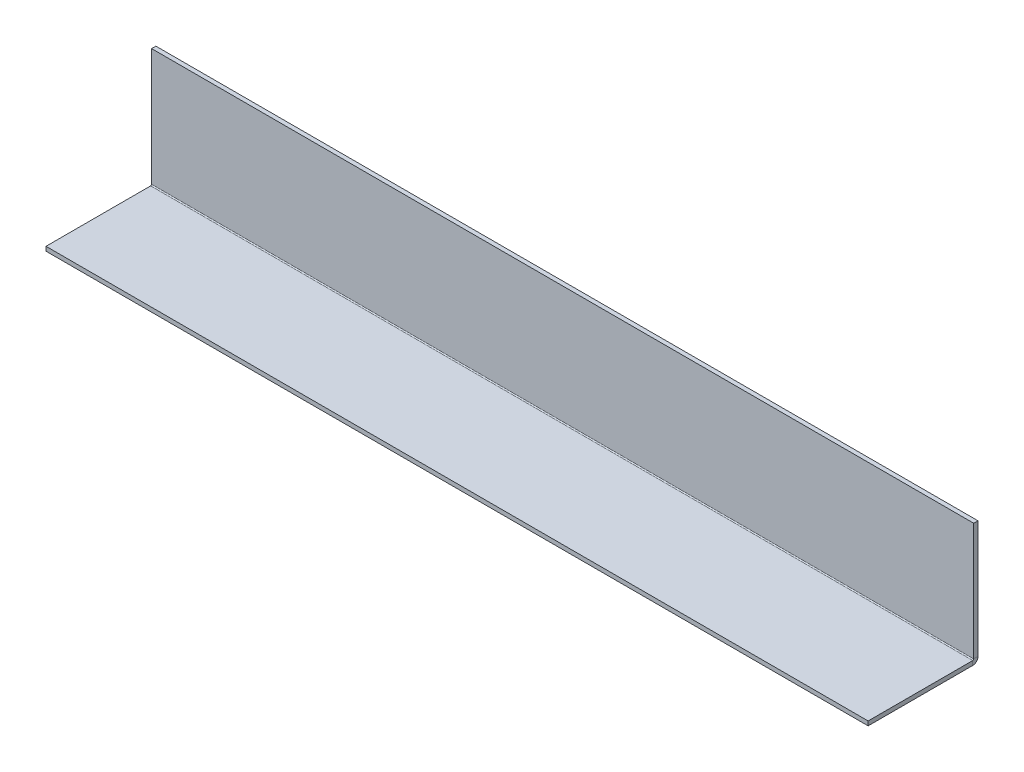
ISO-10303-21;
HEADER;
FILE_DESCRIPTION(('STEP AP214'),'2;1');
FILE_NAME('part.step','',(''),(''),'','','');
FILE_SCHEMA(('AUTOMOTIVE_DESIGN { 1 0 10303 214 1 1 1 1 }'));
ENDSEC;
DATA;
#1=APPLICATION_CONTEXT('core data for automotive mechanical design processes');
#2=APPLICATION_PROTOCOL_DEFINITION('international standard','automotive_design',2000,#1);
#3=PRODUCT_CONTEXT('',#1,'mechanical');
#4=PRODUCT('Part','Part','',(#3));
#5=PRODUCT_RELATED_PRODUCT_CATEGORY('part','',(#4));
#6=PRODUCT_DEFINITION_FORMATION('','',#4);
#7=PRODUCT_DEFINITION_CONTEXT('part definition',#1,'design');
#8=PRODUCT_DEFINITION('design','',#6,#7);
#9=PRODUCT_DEFINITION_SHAPE('','',#8);
#10=(LENGTH_UNIT() NAMED_UNIT(*) SI_UNIT(.MILLI.,.METRE.));
#11=(NAMED_UNIT(*) PLANE_ANGLE_UNIT() SI_UNIT($,.RADIAN.));
#12=(NAMED_UNIT(*) SI_UNIT($,.STERADIAN.) SOLID_ANGLE_UNIT());
#13=UNCERTAINTY_MEASURE_WITH_UNIT(LENGTH_MEASURE(1.E-05),#10,'distance_accuracy_value','');
#14=(GEOMETRIC_REPRESENTATION_CONTEXT(3) GLOBAL_UNCERTAINTY_ASSIGNED_CONTEXT((#13)) GLOBAL_UNIT_ASSIGNED_CONTEXT((#10,
#11,#12)) REPRESENTATION_CONTEXT('',''));
#15=CARTESIAN_POINT('',(0.,0.,0.));
#16=DIRECTION('',(0.,0.,1.));
#17=DIRECTION('',(1.,0.,0.));
#18=AXIS2_PLACEMENT_3D('',#15,#16,#17);
#19=CARTESIAN_POINT('',(304.8,-10.0237561284477,78.286256128448));
#20=DIRECTION('',(1.,0.,0.));
#21=DIRECTION('',(0.,-1.,0.));
#22=AXIS2_PLACEMENT_3D('',#19,#20,#21);
#23=PLANE('',#22);
#24=DIRECTION('',(0.,0.,-1.));
#25=VECTOR('',#24,1.);
#26=CARTESIAN_POINT('',(304.8,-10.0237561284477,78.286256128448));
#27=LINE('',#26,#25);
#28=CARTESIAN_POINT('',(304.8,-10.0237561284477,78.286256128448));
#29=VERTEX_POINT('',#28);
#30=CARTESIAN_POINT('',(304.8,-10.023756128448,0.736600000000014));
#31=VERTEX_POINT('',#30);
#32=EDGE_CURVE('E152',#29,#31,#27,.T.);
#33=ORIENTED_EDGE('',*,*,#32,.T.);
#34=DIRECTION('',(0.,1.,0.));
#35=VECTOR('',#34,1.);
#36=CARTESIAN_POINT('',(304.8,-10.0237561284474,0.7366));
#37=LINE('',#36,#35);
#38=CARTESIAN_POINT('',(304.8,-6.84875612844795,0.736600000000005));
#39=VERTEX_POINT('',#38);
#40=EDGE_CURVE('E48',#31,#39,#37,.T.);
#41=ORIENTED_EDGE('',*,*,#40,.T.);
#42=DIRECTION('',(0.,0.,-1.));
#43=VECTOR('',#42,1.);
#44=CARTESIAN_POINT('',(304.8,-6.84875612844769,78.286256128448));
#45=LINE('',#44,#43);
#46=CARTESIAN_POINT('',(304.8,-6.84875612844769,78.286256128448));
#47=VERTEX_POINT('',#46);
#48=EDGE_CURVE('E121',#47,#39,#45,.T.);
#49=ORIENTED_EDGE('',*,*,#48,.F.);
#50=DIRECTION('',(0.,1.,0.));
#51=VECTOR('',#50,1.);
#52=CARTESIAN_POINT('',(304.8,-10.0237561284477,78.286256128448));
#53=LINE('',#52,#51);
#54=EDGE_CURVE('E153',#29,#47,#53,.T.);
#55=ORIENTED_EDGE('',*,*,#54,.F.);
#56=EDGE_LOOP('',(#33,#41,#49,#55));
#57=FACE_BOUND('',#56,.T.);
#58=ADVANCED_FACE('F41',(#57),#23,.T.);
#59=CARTESIAN_POINT('',(-304.8,-10.0237561284477,78.286256128448));
#60=DIRECTION('',(-1.,0.,0.));
#61=DIRECTION('',(0.,1.,0.));
#62=AXIS2_PLACEMENT_3D('',#59,#60,#61);
#63=PLANE('',#62);
#64=DIRECTION('',(0.,0.,1.));
#65=VECTOR('',#64,1.);
#66=CARTESIAN_POINT('',(-304.8,-6.84875612844769,78.286256128448));
#67=LINE('',#66,#65);
#68=CARTESIAN_POINT('',(-304.8,-6.84875612844795,0.736600000000005));
#69=VERTEX_POINT('',#68);
#70=CARTESIAN_POINT('',(-304.8,-6.84875612844769,78.286256128448));
#71=VERTEX_POINT('',#70);
#72=EDGE_CURVE('E125',#69,#71,#67,.T.);
#73=ORIENTED_EDGE('',*,*,#72,.F.);
#74=DIRECTION('',(0.,-1.,0.));
#75=VECTOR('',#74,1.);
#76=CARTESIAN_POINT('',(-304.8,-10.0237561284474,0.7366));
#77=LINE('',#76,#75);
#78=CARTESIAN_POINT('',(-304.8,-10.0237561284479,0.736600000000029));
#79=VERTEX_POINT('',#78);
#80=EDGE_CURVE('E160',#69,#79,#77,.T.);
#81=ORIENTED_EDGE('',*,*,#80,.T.);
#82=DIRECTION('',(0.,0.,1.));
#83=VECTOR('',#82,1.);
#84=CARTESIAN_POINT('',(-304.8,-10.0237561284477,78.286256128448));
#85=LINE('',#84,#83);
#86=CARTESIAN_POINT('',(-304.8,-10.0237561284477,78.286256128448));
#87=VERTEX_POINT('',#86);
#88=EDGE_CURVE('E148',#79,#87,#85,.T.);
#89=ORIENTED_EDGE('',*,*,#88,.T.);
#90=DIRECTION('',(0.,1.,0.));
#91=VECTOR('',#90,1.);
#92=CARTESIAN_POINT('',(-304.8,-10.0237561284477,78.286256128448));
#93=LINE('',#92,#91);
#94=EDGE_CURVE('E147',#87,#71,#93,.T.);
#95=ORIENTED_EDGE('',*,*,#94,.T.);
#96=EDGE_LOOP('',(#73,#81,#89,#95));
#97=FACE_BOUND('',#96,.T.);
#98=ADVANCED_FACE('F173',(#97),#63,.T.);
#99=CARTESIAN_POINT('',(0.,-10.023756128448,-9.02624387155198));
#100=DIRECTION('',(0.,-1.,0.));
#101=DIRECTION('',(-1.,0.,0.));
#102=AXIS2_PLACEMENT_3D('',#99,#100,#101);
#103=PLANE('',#102);
#104=ORIENTED_EDGE('',*,*,#88,.F.);
#105=DIRECTION('',(1.,0.,0.));
#106=VECTOR('',#105,1.);
#107=CARTESIAN_POINT('',(0.,-10.023756128448,0.7366));
#108=LINE('',#107,#106);
#109=EDGE_CURVE('E155',#79,#31,#108,.T.);
#110=ORIENTED_EDGE('',*,*,#109,.T.);
#111=ORIENTED_EDGE('',*,*,#32,.F.);
#112=DIRECTION('',(1.,0.,0.));
#113=VECTOR('',#112,1.);
#114=CARTESIAN_POINT('',(-304.8,-10.0237561284477,78.286256128448));
#115=LINE('',#114,#113);
#116=EDGE_CURVE('E144',#87,#29,#115,.T.);
#117=ORIENTED_EDGE('',*,*,#116,.F.);
#118=EDGE_LOOP('',(#104,#110,#111,#117));
#119=FACE_BOUND('',#118,.T.);
#120=ADVANCED_FACE('F180',(#119),#103,.T.);
#121=CARTESIAN_POINT('',(-304.8,-10.0237561284477,78.286256128448));
#122=DIRECTION('',(0.,0.,1.));
#123=DIRECTION('',(0.,-1.,0.));
#124=AXIS2_PLACEMENT_3D('',#121,#122,#123);
#125=PLANE('',#124);
#126=DIRECTION('',(1.,0.,0.));
#127=VECTOR('',#126,1.);
#128=CARTESIAN_POINT('',(-304.8,-6.84875612844769,78.286256128448));
#129=LINE('',#128,#127);
#130=EDGE_CURVE('E149',#71,#47,#129,.T.);
#131=ORIENTED_EDGE('',*,*,#130,.F.);
#132=ORIENTED_EDGE('',*,*,#94,.F.);
#133=ORIENTED_EDGE('',*,*,#116,.T.);
#134=ORIENTED_EDGE('',*,*,#54,.T.);
#135=EDGE_LOOP('',(#131,#132,#133,#134));
#136=FACE_BOUND('',#135,.T.);
#137=ADVANCED_FACE('F178',(#136),#125,.T.);
#138=CARTESIAN_POINT('',(0.,-6.848756128448,-9.02624387155199));
#139=DIRECTION('',(0.,-1.,0.));
#140=DIRECTION('',(-1.,0.,0.));
#141=AXIS2_PLACEMENT_3D('',#138,#139,#140);
#142=PLANE('',#141);
#143=DIRECTION('',(1.,0.,0.));
#144=VECTOR('',#143,1.);
#145=CARTESIAN_POINT('',(0.,-6.84875612844796,0.736600000000013));
#146=LINE('',#145,#144);
#147=EDGE_CURVE('E163',#69,#39,#146,.T.);
#148=ORIENTED_EDGE('',*,*,#147,.F.);
#149=ORIENTED_EDGE('',*,*,#72,.T.);
#150=ORIENTED_EDGE('',*,*,#130,.T.);
#151=ORIENTED_EDGE('',*,*,#48,.T.);
#152=EDGE_LOOP('',(#148,#149,#150,#151));
#153=FACE_BOUND('',#152,.T.);
#154=ADVANCED_FACE('F185',(#153),#142,.F.);
#155=CARTESIAN_POINT('',(0.,0.,-3.175));
#156=DIRECTION('',(0.,0.,-1.));
#157=DIRECTION('',(-1.,0.,0.));
#158=AXIS2_PLACEMENT_3D('',#155,#156,#157);
#159=PLANE('',#158);
#160=DIRECTION('',(-1.,0.,0.));
#161=VECTOR('',#160,1.);
#162=CARTESIAN_POINT('',(304.8,80.9625,-3.175));
#163=LINE('',#162,#161);
#164=CARTESIAN_POINT('',(304.8,80.9625,-3.175));
#165=VERTEX_POINT('',#164);
#166=CARTESIAN_POINT('',(-304.8,80.9625,-3.175));
#167=VERTEX_POINT('',#166);
#168=EDGE_CURVE('E104',#165,#167,#163,.T.);
#169=ORIENTED_EDGE('',*,*,#168,.F.);
#170=DIRECTION('',(0.,1.,0.));
#171=VECTOR('',#170,1.);
#172=CARTESIAN_POINT('',(304.8,-87.3125,-3.175));
#173=LINE('',#172,#171);
#174=CARTESIAN_POINT('',(304.8,-6.11215612844795,-3.175));
#175=VERTEX_POINT('',#174);
#176=EDGE_CURVE('E113',#175,#165,#173,.T.);
#177=ORIENTED_EDGE('',*,*,#176,.F.);
#178=DIRECTION('',(1.,0.,0.));
#179=VECTOR('',#178,1.);
#180=CARTESIAN_POINT('',(0.,-6.11215612844795,-3.175));
#181=LINE('',#180,#179);
#182=CARTESIAN_POINT('',(-304.8,-6.11215612844795,-3.175));
#183=VERTEX_POINT('',#182);
#184=EDGE_CURVE('E142',#183,#175,#181,.T.);
#185=ORIENTED_EDGE('',*,*,#184,.F.);
#186=DIRECTION('',(0.,-1.,0.));
#187=VECTOR('',#186,1.);
#188=CARTESIAN_POINT('',(-304.8,-87.3125,-3.175));
#189=LINE('',#188,#187);
#190=EDGE_CURVE('E115',#167,#183,#189,.T.);
#191=ORIENTED_EDGE('',*,*,#190,.F.);
#192=EDGE_LOOP('',(#169,#177,#185,#191));
#193=FACE_BOUND('',#192,.T.);
#194=ADVANCED_FACE('F111',(#193),#159,.T.);
#195=CARTESIAN_POINT('',(-304.8,-87.3125,-3.175));
#196=DIRECTION('',(-1.,0.,0.));
#197=DIRECTION('',(0.,0.,1.));
#198=AXIS2_PLACEMENT_3D('',#195,#196,#197);
#199=PLANE('',#198);
#200=DIRECTION('',(0.,0.,-1.));
#201=VECTOR('',#200,1.);
#202=CARTESIAN_POINT('',(-304.8,80.9625,78.286256128448));
#203=LINE('',#202,#201);
#204=CARTESIAN_POINT('',(-304.8,80.9625,0.));
#205=VERTEX_POINT('',#204);
#206=EDGE_CURVE('E116',#205,#167,#203,.T.);
#207=ORIENTED_EDGE('',*,*,#206,.T.);
#208=ORIENTED_EDGE('',*,*,#190,.T.);
#209=DIRECTION('',(0.,0.,-1.));
#210=VECTOR('',#209,1.);
#211=CARTESIAN_POINT('',(-304.8,-6.11215612844794,-3.17499999999943));
#212=LINE('',#211,#210);
#213=CARTESIAN_POINT('',(-304.8,-6.11215612844797,0.));
#214=VERTEX_POINT('',#213);
#215=EDGE_CURVE('E138',#214,#183,#212,.T.);
#216=ORIENTED_EDGE('',*,*,#215,.F.);
#217=DIRECTION('',(0.,-1.,0.));
#218=VECTOR('',#217,1.);
#219=CARTESIAN_POINT('',(-304.8,-87.3125,0.));
#220=LINE('',#219,#218);
#221=EDGE_CURVE('E135',#205,#214,#220,.T.);
#222=ORIENTED_EDGE('',*,*,#221,.F.);
#223=EDGE_LOOP('',(#207,#208,#216,#222));
#224=FACE_BOUND('',#223,.T.);
#225=ADVANCED_FACE('F205',(#224),#199,.T.);
#226=CARTESIAN_POINT('',(0.,0.,0.));
#227=DIRECTION('',(0.,0.,-1.));
#228=DIRECTION('',(-1.,0.,0.));
#229=AXIS2_PLACEMENT_3D('',#226,#227,#228);
#230=PLANE('',#229);
#231=DIRECTION('',(0.,1.,0.));
#232=VECTOR('',#231,1.);
#233=CARTESIAN_POINT('',(304.8,-87.3125,0.));
#234=LINE('',#233,#232);
#235=CARTESIAN_POINT('',(304.8,-6.11215612844797,0.));
#236=VERTEX_POINT('',#235);
#237=CARTESIAN_POINT('',(304.8,80.9625,0.));
#238=VERTEX_POINT('',#237);
#239=EDGE_CURVE('E122',#236,#238,#234,.T.);
#240=ORIENTED_EDGE('',*,*,#239,.T.);
#241=DIRECTION('',(-1.,0.,0.));
#242=VECTOR('',#241,1.);
#243=CARTESIAN_POINT('',(0.,80.9625,0.));
#244=LINE('',#243,#242);
#245=EDGE_CURVE('E54',#238,#205,#244,.T.);
#246=ORIENTED_EDGE('',*,*,#245,.T.);
#247=ORIENTED_EDGE('',*,*,#221,.T.);
#248=DIRECTION('',(1.,0.,0.));
#249=VECTOR('',#248,1.);
#250=CARTESIAN_POINT('',(0.,-6.11215612844797,0.));
#251=LINE('',#250,#249);
#252=EDGE_CURVE('E127',#214,#236,#251,.T.);
#253=ORIENTED_EDGE('',*,*,#252,.T.);
#254=EDGE_LOOP('',(#240,#246,#247,#253));
#255=FACE_BOUND('',#254,.T.);
#256=ADVANCED_FACE('F208',(#255),#230,.F.);
#257=CARTESIAN_POINT('',(304.8,-87.3125,-3.175));
#258=DIRECTION('',(1.,0.,0.));
#259=DIRECTION('',(0.,0.,-1.));
#260=AXIS2_PLACEMENT_3D('',#257,#258,#259);
#261=PLANE('',#260);
#262=DIRECTION('',(0.,0.,-1.));
#263=VECTOR('',#262,1.);
#264=CARTESIAN_POINT('',(304.8,80.9625,-3.175));
#265=LINE('',#264,#263);
#266=EDGE_CURVE('E12',#238,#165,#265,.T.);
#267=ORIENTED_EDGE('',*,*,#266,.F.);
#268=ORIENTED_EDGE('',*,*,#239,.F.);
#269=DIRECTION('',(0.,0.,1.));
#270=VECTOR('',#269,1.);
#271=CARTESIAN_POINT('',(304.8,-6.11215612844794,-3.17499999999943));
#272=LINE('',#271,#270);
#273=EDGE_CURVE('E120',#175,#236,#272,.T.);
#274=ORIENTED_EDGE('',*,*,#273,.F.);
#275=ORIENTED_EDGE('',*,*,#176,.T.);
#276=EDGE_LOOP('',(#267,#268,#274,#275));
#277=FACE_BOUND('',#276,.T.);
#278=ADVANCED_FACE('F118',(#277),#261,.T.);
#279=CARTESIAN_POINT('',(-304.8,-6.11215612844795,0.7366));
#280=DIRECTION('',(-1.,0.,0.));
#281=DIRECTION('',(0.,0.,1.));
#282=AXIS2_PLACEMENT_3D('',#279,#280,#281);
#283=PLANE('',#282);
#284=ORIENTED_EDGE('',*,*,#80,.F.);
#285=CARTESIAN_POINT('',(-304.8,-6.11215612844795,0.7366));
#286=DIRECTION('',(-1.,0.,0.));
#287=DIRECTION('',(0.,0.,1.));
#288=AXIS2_PLACEMENT_3D('',#285,#286,#287);
#289=CIRCLE('',#288,0.7366);
#290=EDGE_CURVE('E193',#69,#214,#289,.F.);
#291=ORIENTED_EDGE('',*,*,#290,.T.);
#292=ORIENTED_EDGE('',*,*,#215,.T.);
#293=CARTESIAN_POINT('',(-304.8,-6.11215612844795,0.7366));
#294=DIRECTION('',(1.,0.,0.));
#295=DIRECTION('',(0.,0.,1.));
#296=AXIS2_PLACEMENT_3D('',#293,#294,#295);
#297=CIRCLE('',#296,3.9116);
#298=EDGE_CURVE('E196',#79,#183,#297,.T.);
#299=ORIENTED_EDGE('',*,*,#298,.F.);
#300=EDGE_LOOP('',(#284,#291,#292,#299));
#301=FACE_BOUND('',#300,.T.);
#302=ADVANCED_FACE('F210',(#301),#283,.T.);
#303=CARTESIAN_POINT('',(304.8,-6.11215612844795,0.7366));
#304=DIRECTION('',(1.,0.,0.));
#305=DIRECTION('',(0.,0.,-1.));
#306=AXIS2_PLACEMENT_3D('',#303,#304,#305);
#307=PLANE('',#306);
#308=CARTESIAN_POINT('',(304.8,-6.11215612844795,0.7366));
#309=DIRECTION('',(-1.,0.,0.));
#310=DIRECTION('',(0.,0.,1.));
#311=AXIS2_PLACEMENT_3D('',#308,#309,#310);
#312=CIRCLE('',#311,0.7366);
#313=EDGE_CURVE('E130',#236,#39,#312,.T.);
#314=ORIENTED_EDGE('',*,*,#313,.T.);
#315=ORIENTED_EDGE('',*,*,#40,.F.);
#316=CARTESIAN_POINT('',(304.8,-6.11215612844795,0.7366));
#317=DIRECTION('',(-1.,0.,0.));
#318=DIRECTION('',(0.,0.,-1.));
#319=AXIS2_PLACEMENT_3D('',#316,#317,#318);
#320=CIRCLE('',#319,3.9116);
#321=EDGE_CURVE('E62',#175,#31,#320,.T.);
#322=ORIENTED_EDGE('',*,*,#321,.F.);
#323=ORIENTED_EDGE('',*,*,#273,.T.);
#324=EDGE_LOOP('',(#314,#315,#322,#323));
#325=FACE_BOUND('',#324,.T.);
#326=ADVANCED_FACE('F195',(#325),#307,.T.);
#327=CARTESIAN_POINT('',(609.619199292474,-6.11215612844795,0.7366));
#328=DIRECTION('',(-1.,0.,0.));
#329=DIRECTION('',(0.,0.,1.));
#330=AXIS2_PLACEMENT_3D('',#327,#328,#329);
#331=CYLINDRICAL_SURFACE('',#330,3.9116);
#332=ORIENTED_EDGE('',*,*,#184,.T.);
#333=ORIENTED_EDGE('',*,*,#321,.T.);
#334=ORIENTED_EDGE('',*,*,#109,.F.);
#335=ORIENTED_EDGE('',*,*,#298,.T.);
#336=EDGE_LOOP('',(#332,#333,#334,#335));
#337=FACE_BOUND('',#336,.T.);
#338=ADVANCED_FACE('F211',(#337),#331,.T.);
#339=CARTESIAN_POINT('',(609.619199292474,-6.11215612844795,0.7366));
#340=DIRECTION('',(-1.,0.,0.));
#341=DIRECTION('',(0.,0.,1.));
#342=AXIS2_PLACEMENT_3D('',#339,#340,#341);
#343=CYLINDRICAL_SURFACE('',#342,0.7366);
#344=ORIENTED_EDGE('',*,*,#252,.F.);
#345=ORIENTED_EDGE('',*,*,#290,.F.);
#346=ORIENTED_EDGE('',*,*,#147,.T.);
#347=ORIENTED_EDGE('',*,*,#313,.F.);
#348=EDGE_LOOP('',(#344,#345,#346,#347));
#349=FACE_BOUND('',#348,.T.);
#350=ADVANCED_FACE('F191',(#349),#343,.F.);
#351=CARTESIAN_POINT('',(304.8,80.9625,78.286256128448));
#352=DIRECTION('',(0.,-1.,0.));
#353=DIRECTION('',(0.,0.,-1.));
#354=AXIS2_PLACEMENT_3D('',#351,#352,#353);
#355=PLANE('',#354);
#356=ORIENTED_EDGE('',*,*,#266,.T.);
#357=ORIENTED_EDGE('',*,*,#168,.T.);
#358=ORIENTED_EDGE('',*,*,#206,.F.);
#359=ORIENTED_EDGE('',*,*,#245,.F.);
#360=EDGE_LOOP('',(#356,#357,#358,#359));
#361=FACE_BOUND('',#360,.T.);
#362=ADVANCED_FACE('F103',(#361),#355,.F.);
#363=CLOSED_SHELL('',(#58,#98,#120,#137,#154,#194,#225,#256,#278,#302,#326,#338,#350,#362));
#364=MANIFOLD_SOLID_BREP('B2',#363);
#365=ADVANCED_BREP_SHAPE_REPRESENTATION('',(#18,#364),#14);
#366=SHAPE_DEFINITION_REPRESENTATION(#9,#365);
ENDSEC;
END-ISO-10303-21;
